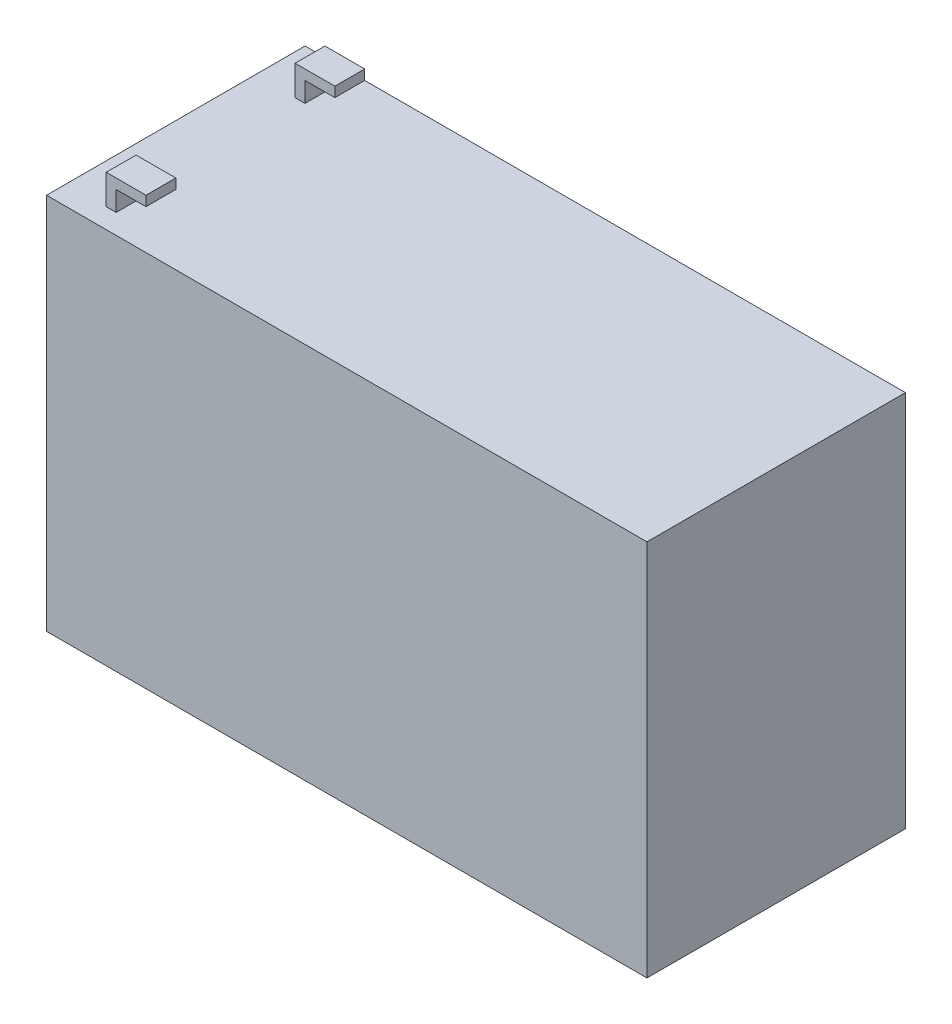
ISO-10303-21;
HEADER;
FILE_DESCRIPTION(('STEP AP214'),'2;1');
FILE_NAME('part.step','',(''),(''),'','','');
FILE_SCHEMA(('AUTOMOTIVE_DESIGN { 1 0 10303 214 1 1 1 1 }'));
ENDSEC;
DATA;
#1=APPLICATION_CONTEXT('core data for automotive mechanical design processes');
#2=APPLICATION_PROTOCOL_DEFINITION('international standard','automotive_design',2000,#1);
#3=PRODUCT_CONTEXT('',#1,'mechanical');
#4=PRODUCT('Part','Part','',(#3));
#5=PRODUCT_RELATED_PRODUCT_CATEGORY('part','',(#4));
#6=PRODUCT_DEFINITION_FORMATION('','',#4);
#7=PRODUCT_DEFINITION_CONTEXT('part definition',#1,'design');
#8=PRODUCT_DEFINITION('design','',#6,#7);
#9=PRODUCT_DEFINITION_SHAPE('','',#8);
#10=(LENGTH_UNIT() NAMED_UNIT(*) SI_UNIT(.MILLI.,.METRE.));
#11=(NAMED_UNIT(*) PLANE_ANGLE_UNIT() SI_UNIT($,.RADIAN.));
#12=(NAMED_UNIT(*) SI_UNIT($,.STERADIAN.) SOLID_ANGLE_UNIT());
#13=UNCERTAINTY_MEASURE_WITH_UNIT(LENGTH_MEASURE(1.E-05),#10,'distance_accuracy_value','');
#14=(GEOMETRIC_REPRESENTATION_CONTEXT(3) GLOBAL_UNCERTAINTY_ASSIGNED_CONTEXT((#13)) GLOBAL_UNIT_ASSIGNED_CONTEXT((#10,
#11,#12)) REPRESENTATION_CONTEXT('',''));
#15=CARTESIAN_POINT('',(0.,0.,0.));
#16=DIRECTION('',(0.,0.,1.));
#17=DIRECTION('',(1.,0.,0.));
#18=AXIS2_PLACEMENT_3D('',#15,#16,#17);
#19=CARTESIAN_POINT('',(-75.5,-47.5,-65.));
#20=DIRECTION('',(0.,-1.,0.));
#21=DIRECTION('',(0.,0.,-1.));
#22=AXIS2_PLACEMENT_3D('',#19,#20,#21);
#23=PLANE('',#22);
#24=DIRECTION('',(1.,0.,0.));
#25=VECTOR('',#24,1.);
#26=CARTESIAN_POINT('',(-75.5,-47.5,0.));
#27=LINE('',#26,#25);
#28=CARTESIAN_POINT('',(-75.5,-47.5,0.));
#29=VERTEX_POINT('',#28);
#30=CARTESIAN_POINT('',(75.5,-47.5,0.));
#31=VERTEX_POINT('',#30);
#32=EDGE_CURVE('E489',#29,#31,#27,.T.);
#33=ORIENTED_EDGE('',*,*,#32,.F.);
#34=DIRECTION('',(0.,0.,1.));
#35=VECTOR('',#34,1.);
#36=CARTESIAN_POINT('',(-75.5,-47.5,-65.));
#37=LINE('',#36,#35);
#38=CARTESIAN_POINT('',(-75.5,-47.5,-65.));
#39=VERTEX_POINT('',#38);
#40=EDGE_CURVE('E40',#39,#29,#37,.T.);
#41=ORIENTED_EDGE('',*,*,#40,.F.);
#42=DIRECTION('',(1.,0.,0.));
#43=VECTOR('',#42,1.);
#44=CARTESIAN_POINT('',(-75.5,-47.5,-65.));
#45=LINE('',#44,#43);
#46=CARTESIAN_POINT('',(75.5,-47.5,-65.));
#47=VERTEX_POINT('',#46);
#48=EDGE_CURVE('E477',#39,#47,#45,.T.);
#49=ORIENTED_EDGE('',*,*,#48,.T.);
#50=DIRECTION('',(0.,0.,1.));
#51=VECTOR('',#50,1.);
#52=CARTESIAN_POINT('',(75.5,-47.5,-65.));
#53=LINE('',#52,#51);
#54=EDGE_CURVE('E496',#47,#31,#53,.T.);
#55=ORIENTED_EDGE('',*,*,#54,.T.);
#56=EDGE_LOOP('',(#33,#41,#49,#55));
#57=FACE_BOUND('',#56,.T.);
#58=DIRECTION('',(0.,0.,1.));
#59=VECTOR('',#58,1.);
#60=CARTESIAN_POINT('',(-74.5,-47.5,-65.));
#61=LINE('',#60,#59);
#62=CARTESIAN_POINT('',(-74.5,-47.5,-64.));
#63=VERTEX_POINT('',#62);
#64=CARTESIAN_POINT('',(-74.5,-47.5,-1.));
#65=VERTEX_POINT('',#64);
#66=EDGE_CURVE('E335',#63,#65,#61,.T.);
#67=ORIENTED_EDGE('',*,*,#66,.T.);
#68=DIRECTION('',(1.,0.,0.));
#69=VECTOR('',#68,1.);
#70=CARTESIAN_POINT('',(0.,-47.5,-1.));
#71=LINE('',#70,#69);
#72=CARTESIAN_POINT('',(74.5,-47.5,-1.));
#73=VERTEX_POINT('',#72);
#74=EDGE_CURVE('E351',#65,#73,#71,.T.);
#75=ORIENTED_EDGE('',*,*,#74,.T.);
#76=DIRECTION('',(0.,0.,1.));
#77=VECTOR('',#76,1.);
#78=CARTESIAN_POINT('',(74.5,-47.5,-65.));
#79=LINE('',#78,#77);
#80=CARTESIAN_POINT('',(74.5,-47.5,-64.));
#81=VERTEX_POINT('',#80);
#82=EDGE_CURVE('E347',#81,#73,#79,.T.);
#83=ORIENTED_EDGE('',*,*,#82,.F.);
#84=DIRECTION('',(1.,0.,0.));
#85=VECTOR('',#84,1.);
#86=CARTESIAN_POINT('',(0.,-47.5,-64.));
#87=LINE('',#86,#85);
#88=EDGE_CURVE('E53',#63,#81,#87,.T.);
#89=ORIENTED_EDGE('',*,*,#88,.F.);
#90=EDGE_LOOP('',(#67,#75,#83,#89));
#91=FACE_BOUND('',#90,.T.);
#92=ADVANCED_FACE('F36',(#57,#91),#23,.T.);
#93=CARTESIAN_POINT('',(-65.5,47.5,-65.));
#94=DIRECTION('',(-1.,0.,0.));
#95=DIRECTION('',(0.,0.,1.));
#96=AXIS2_PLACEMENT_3D('',#93,#94,#95);
#97=PLANE('',#96);
#98=DIRECTION('',(0.,1.,0.));
#99=VECTOR('',#98,1.);
#100=CARTESIAN_POINT('',(-65.5,47.5,-60.));
#101=LINE('',#100,#99);
#102=CARTESIAN_POINT('',(-65.5,47.5,-60.));
#103=VERTEX_POINT('',#102);
#104=CARTESIAN_POINT('',(-65.5,55.,-60.));
#105=VERTEX_POINT('',#104);
#106=EDGE_CURVE('E399',#103,#105,#101,.T.);
#107=ORIENTED_EDGE('',*,*,#106,.F.);
#108=DIRECTION('',(0.,0.,1.));
#109=VECTOR('',#108,1.);
#110=CARTESIAN_POINT('',(-65.5,47.5,-65.));
#111=LINE('',#110,#109);
#112=CARTESIAN_POINT('',(-65.5,47.5,-52.5));
#113=VERTEX_POINT('',#112);
#114=EDGE_CURVE('E455',#103,#113,#111,.T.);
#115=ORIENTED_EDGE('',*,*,#114,.T.);
#116=DIRECTION('',(0.,-1.,0.));
#117=VECTOR('',#116,1.);
#118=CARTESIAN_POINT('',(-65.5,55.,-52.5));
#119=LINE('',#118,#117);
#120=CARTESIAN_POINT('',(-65.5,55.,-52.5));
#121=VERTEX_POINT('',#120);
#122=EDGE_CURVE('E420',#121,#113,#119,.T.);
#123=ORIENTED_EDGE('',*,*,#122,.F.);
#124=DIRECTION('',(0.,0.,1.));
#125=VECTOR('',#124,1.);
#126=CARTESIAN_POINT('',(-65.5,55.,-65.));
#127=LINE('',#126,#125);
#128=EDGE_CURVE('E456',#105,#121,#127,.T.);
#129=ORIENTED_EDGE('',*,*,#128,.F.);
#130=EDGE_LOOP('',(#107,#115,#123,#129));
#131=FACE_BOUND('',#130,.T.);
#132=ADVANCED_FACE('F527',(#131),#97,.T.);
#133=CARTESIAN_POINT('',(-65.5,55.,-65.));
#134=DIRECTION('',(0.,1.,0.));
#135=DIRECTION('',(0.,0.,1.));
#136=AXIS2_PLACEMENT_3D('',#133,#134,#135);
#137=PLANE('',#136);
#138=DIRECTION('',(-1.,0.,0.));
#139=VECTOR('',#138,1.);
#140=CARTESIAN_POINT('',(75.501,55.,-60.));
#141=LINE('',#140,#139);
#142=CARTESIAN_POINT('',(-55.5,55.,-60.));
#143=VERTEX_POINT('',#142);
#144=EDGE_CURVE('E401',#143,#105,#141,.T.);
#145=ORIENTED_EDGE('',*,*,#144,.T.);
#146=ORIENTED_EDGE('',*,*,#128,.T.);
#147=DIRECTION('',(-1.,0.,0.));
#148=VECTOR('',#147,1.);
#149=CARTESIAN_POINT('',(75.501,55.,-52.5));
#150=LINE('',#149,#148);
#151=CARTESIAN_POINT('',(-55.5,55.,-52.5));
#152=VERTEX_POINT('',#151);
#153=EDGE_CURVE('E426',#152,#121,#150,.T.);
#154=ORIENTED_EDGE('',*,*,#153,.F.);
#155=DIRECTION('',(0.,0.,1.));
#156=VECTOR('',#155,1.);
#157=CARTESIAN_POINT('',(-55.5,55.,-65.));
#158=LINE('',#157,#156);
#159=EDGE_CURVE('E460',#143,#152,#158,.T.);
#160=ORIENTED_EDGE('',*,*,#159,.F.);
#161=EDGE_LOOP('',(#145,#146,#154,#160));
#162=FACE_BOUND('',#161,.T.);
#163=ADVANCED_FACE('F531',(#162),#137,.T.);
#164=CARTESIAN_POINT('',(-55.5,55.,-65.));
#165=DIRECTION('',(1.,0.,0.));
#166=DIRECTION('',(0.,0.,-1.));
#167=AXIS2_PLACEMENT_3D('',#164,#165,#166);
#168=PLANE('',#167);
#169=DIRECTION('',(0.,1.,0.));
#170=VECTOR('',#169,1.);
#171=CARTESIAN_POINT('',(-55.5,47.5,-60.));
#172=LINE('',#171,#170);
#173=CARTESIAN_POINT('',(-55.5,52.5,-60.));
#174=VERTEX_POINT('',#173);
#175=EDGE_CURVE('E389',#174,#143,#172,.T.);
#176=ORIENTED_EDGE('',*,*,#175,.T.);
#177=ORIENTED_EDGE('',*,*,#159,.T.);
#178=DIRECTION('',(0.,-1.,0.));
#179=VECTOR('',#178,1.);
#180=CARTESIAN_POINT('',(-55.5,55.,-52.5));
#181=LINE('',#180,#179);
#182=CARTESIAN_POINT('',(-55.5,52.5,-52.5));
#183=VERTEX_POINT('',#182);
#184=EDGE_CURVE('E417',#152,#183,#181,.T.);
#185=ORIENTED_EDGE('',*,*,#184,.T.);
#186=DIRECTION('',(0.,0.,1.));
#187=VECTOR('',#186,1.);
#188=CARTESIAN_POINT('',(-55.5,52.5,-65.));
#189=LINE('',#188,#187);
#190=EDGE_CURVE('E464',#174,#183,#189,.T.);
#191=ORIENTED_EDGE('',*,*,#190,.F.);
#192=EDGE_LOOP('',(#176,#177,#185,#191));
#193=FACE_BOUND('',#192,.T.);
#194=ADVANCED_FACE('F538',(#193),#168,.T.);
#195=CARTESIAN_POINT('',(-55.5,52.5,-65.));
#196=DIRECTION('',(0.,-1.,0.));
#197=DIRECTION('',(0.,0.,-1.));
#198=AXIS2_PLACEMENT_3D('',#195,#196,#197);
#199=PLANE('',#198);
#200=DIRECTION('',(1.,0.,0.));
#201=VECTOR('',#200,1.);
#202=CARTESIAN_POINT('',(75.501,52.5,-60.));
#203=LINE('',#202,#201);
#204=CARTESIAN_POINT('',(-63.,52.5,-60.));
#205=VERTEX_POINT('',#204);
#206=EDGE_CURVE('E396',#205,#174,#203,.T.);
#207=ORIENTED_EDGE('',*,*,#206,.T.);
#208=ORIENTED_EDGE('',*,*,#190,.T.);
#209=DIRECTION('',(-1.,0.,0.));
#210=VECTOR('',#209,1.);
#211=CARTESIAN_POINT('',(75.501,52.5,-52.5));
#212=LINE('',#211,#210);
#213=CARTESIAN_POINT('',(-63.,52.5,-52.5));
#214=VERTEX_POINT('',#213);
#215=EDGE_CURVE('E414',#183,#214,#212,.T.);
#216=ORIENTED_EDGE('',*,*,#215,.T.);
#217=DIRECTION('',(0.,0.,1.));
#218=VECTOR('',#217,1.);
#219=CARTESIAN_POINT('',(-63.,52.5,-65.));
#220=LINE('',#219,#218);
#221=EDGE_CURVE('E468',#205,#214,#220,.T.);
#222=ORIENTED_EDGE('',*,*,#221,.F.);
#223=EDGE_LOOP('',(#207,#208,#216,#222));
#224=FACE_BOUND('',#223,.T.);
#225=ADVANCED_FACE('F579',(#224),#199,.T.);
#226=CARTESIAN_POINT('',(-63.,52.5,-65.));
#227=DIRECTION('',(1.,0.,0.));
#228=DIRECTION('',(0.,0.,-1.));
#229=AXIS2_PLACEMENT_3D('',#226,#227,#228);
#230=PLANE('',#229);
#231=DIRECTION('',(0.,1.,0.));
#232=VECTOR('',#231,1.);
#233=CARTESIAN_POINT('',(-63.,47.5,-60.));
#234=LINE('',#233,#232);
#235=CARTESIAN_POINT('',(-63.,47.5,-60.));
#236=VERTEX_POINT('',#235);
#237=EDGE_CURVE('E392',#236,#205,#234,.T.);
#238=ORIENTED_EDGE('',*,*,#237,.T.);
#239=ORIENTED_EDGE('',*,*,#221,.T.);
#240=DIRECTION('',(0.,-1.,0.));
#241=VECTOR('',#240,1.);
#242=CARTESIAN_POINT('',(-63.,55.,-52.5));
#243=LINE('',#242,#241);
#244=CARTESIAN_POINT('',(-63.,47.5,-52.5));
#245=VERTEX_POINT('',#244);
#246=EDGE_CURVE('E410',#214,#245,#243,.T.);
#247=ORIENTED_EDGE('',*,*,#246,.T.);
#248=DIRECTION('',(0.,0.,1.));
#249=VECTOR('',#248,1.);
#250=CARTESIAN_POINT('',(-63.,47.5,-65.));
#251=LINE('',#250,#249);
#252=EDGE_CURVE('E472',#236,#245,#251,.T.);
#253=ORIENTED_EDGE('',*,*,#252,.F.);
#254=EDGE_LOOP('',(#238,#239,#247,#253));
#255=FACE_BOUND('',#254,.T.);
#256=ADVANCED_FACE('F572',(#255),#230,.T.);
#257=CARTESIAN_POINT('',(-75.5,47.5,-65.));
#258=DIRECTION('',(-1.,0.,0.));
#259=DIRECTION('',(0.,0.,1.));
#260=AXIS2_PLACEMENT_3D('',#257,#258,#259);
#261=PLANE('',#260);
#262=DIRECTION('',(0.,-1.,0.));
#263=VECTOR('',#262,1.);
#264=CARTESIAN_POINT('',(-75.5,47.5,0.));
#265=LINE('',#264,#263);
#266=CARTESIAN_POINT('',(-75.5,47.5,0.));
#267=VERTEX_POINT('',#266);
#268=EDGE_CURVE('E486',#267,#29,#265,.T.);
#269=ORIENTED_EDGE('',*,*,#268,.F.);
#270=DIRECTION('',(0.,0.,1.));
#271=VECTOR('',#270,1.);
#272=CARTESIAN_POINT('',(-75.5,47.5,-65.));
#273=LINE('',#272,#271);
#274=CARTESIAN_POINT('',(-75.5,47.5,-65.));
#275=VERTEX_POINT('',#274);
#276=EDGE_CURVE('E11',#275,#267,#273,.T.);
#277=ORIENTED_EDGE('',*,*,#276,.F.);
#278=DIRECTION('',(0.,-1.,0.));
#279=VECTOR('',#278,1.);
#280=CARTESIAN_POINT('',(-75.5,47.5,-65.));
#281=LINE('',#280,#279);
#282=EDGE_CURVE('E474',#275,#39,#281,.T.);
#283=ORIENTED_EDGE('',*,*,#282,.T.);
#284=ORIENTED_EDGE('',*,*,#40,.T.);
#285=EDGE_LOOP('',(#269,#277,#283,#284));
#286=FACE_BOUND('',#285,.T.);
#287=ADVANCED_FACE('F38',(#286),#261,.T.);
#288=CARTESIAN_POINT('',(-75.5,47.5,-65.));
#289=DIRECTION('',(0.,1.,0.));
#290=DIRECTION('',(0.,0.,1.));
#291=AXIS2_PLACEMENT_3D('',#288,#289,#290);
#292=PLANE('',#291);
#293=ORIENTED_EDGE('',*,*,#114,.F.);
#294=DIRECTION('',(-1.,0.,0.));
#295=VECTOR('',#294,1.);
#296=CARTESIAN_POINT('',(75.501,47.5,-60.));
#297=LINE('',#296,#295);
#298=EDGE_CURVE('E402',#236,#103,#297,.T.);
#299=ORIENTED_EDGE('',*,*,#298,.F.);
#300=ORIENTED_EDGE('',*,*,#252,.T.);
#301=DIRECTION('',(-1.,0.,0.));
#302=VECTOR('',#301,1.);
#303=CARTESIAN_POINT('',(75.501,47.5,-52.5));
#304=LINE('',#303,#302);
#305=EDGE_CURVE('E425',#245,#113,#304,.T.);
#306=ORIENTED_EDGE('',*,*,#305,.T.);
#307=EDGE_LOOP('',(#293,#299,#300,#306));
#308=FACE_BOUND('',#307,.T.);
#309=CARTESIAN_POINT('',(-65.5,47.5,-12.5));
#310=VERTEX_POINT('',#309);
#311=CARTESIAN_POINT('',(-65.5,47.5,-5.));
#312=VERTEX_POINT('',#311);
#313=EDGE_CURVE('E452',#310,#312,#111,.T.);
#314=ORIENTED_EDGE('',*,*,#313,.F.);
#315=DIRECTION('',(-1.,0.,0.));
#316=VECTOR('',#315,1.);
#317=CARTESIAN_POINT('',(75.501,47.5,-12.5));
#318=LINE('',#317,#316);
#319=CARTESIAN_POINT('',(-63.,47.5,-12.5));
#320=VERTEX_POINT('',#319);
#321=EDGE_CURVE('E61',#320,#310,#318,.T.);
#322=ORIENTED_EDGE('',*,*,#321,.F.);
#323=CARTESIAN_POINT('',(-63.,47.5,-5.));
#324=VERTEX_POINT('',#323);
#325=EDGE_CURVE('E404',#320,#324,#251,.T.);
#326=ORIENTED_EDGE('',*,*,#325,.T.);
#327=DIRECTION('',(-1.,0.,0.));
#328=VECTOR('',#327,1.);
#329=CARTESIAN_POINT('',(75.501,47.5,-5.));
#330=LINE('',#329,#328);
#331=EDGE_CURVE('E449',#324,#312,#330,.T.);
#332=ORIENTED_EDGE('',*,*,#331,.T.);
#333=EDGE_LOOP('',(#314,#322,#326,#332));
#334=FACE_BOUND('',#333,.T.);
#335=DIRECTION('',(-1.,0.,0.));
#336=VECTOR('',#335,1.);
#337=CARTESIAN_POINT('',(-75.5,47.5,-65.));
#338=LINE('',#337,#336);
#339=CARTESIAN_POINT('',(75.5,47.5,-65.));
#340=VERTEX_POINT('',#339);
#341=EDGE_CURVE('E484',#340,#275,#338,.T.);
#342=ORIENTED_EDGE('',*,*,#341,.T.);
#343=ORIENTED_EDGE('',*,*,#276,.T.);
#344=DIRECTION('',(-1.,0.,0.));
#345=VECTOR('',#344,1.);
#346=CARTESIAN_POINT('',(-75.5,47.5,0.));
#347=LINE('',#346,#345);
#348=CARTESIAN_POINT('',(75.5,47.5,0.));
#349=VERTEX_POINT('',#348);
#350=EDGE_CURVE('E478',#349,#267,#347,.T.);
#351=ORIENTED_EDGE('',*,*,#350,.F.);
#352=DIRECTION('',(0.,0.,1.));
#353=VECTOR('',#352,1.);
#354=CARTESIAN_POINT('',(75.5,47.5,-65.));
#355=LINE('',#354,#353);
#356=EDGE_CURVE('E45',#340,#349,#355,.T.);
#357=ORIENTED_EDGE('',*,*,#356,.F.);
#358=EDGE_LOOP('',(#342,#343,#351,#357));
#359=FACE_BOUND('',#358,.T.);
#360=ADVANCED_FACE('F510',(#308,#334,#359),#292,.T.);
#361=CARTESIAN_POINT('',(75.5,47.5,-65.));
#362=DIRECTION('',(1.,0.,0.));
#363=DIRECTION('',(0.,0.,-1.));
#364=AXIS2_PLACEMENT_3D('',#361,#362,#363);
#365=PLANE('',#364);
#366=DIRECTION('',(0.,1.,0.));
#367=VECTOR('',#366,1.);
#368=CARTESIAN_POINT('',(75.5,47.5,0.));
#369=LINE('',#368,#367);
#370=EDGE_CURVE('E492',#31,#349,#369,.T.);
#371=ORIENTED_EDGE('',*,*,#370,.F.);
#372=ORIENTED_EDGE('',*,*,#54,.F.);
#373=DIRECTION('',(0.,1.,0.));
#374=VECTOR('',#373,1.);
#375=CARTESIAN_POINT('',(75.5,47.5,-65.));
#376=LINE('',#375,#374);
#377=EDGE_CURVE('E481',#47,#340,#376,.T.);
#378=ORIENTED_EDGE('',*,*,#377,.T.);
#379=ORIENTED_EDGE('',*,*,#356,.T.);
#380=EDGE_LOOP('',(#371,#372,#378,#379));
#381=FACE_BOUND('',#380,.T.);
#382=ADVANCED_FACE('F516',(#381),#365,.T.);
#383=CARTESIAN_POINT('',(0.,0.,-65.));
#384=DIRECTION('',(0.,0.,1.));
#385=DIRECTION('',(1.,0.,0.));
#386=AXIS2_PLACEMENT_3D('',#383,#384,#385);
#387=PLANE('',#386);
#388=ORIENTED_EDGE('',*,*,#282,.F.);
#389=ORIENTED_EDGE('',*,*,#341,.F.);
#390=ORIENTED_EDGE('',*,*,#377,.F.);
#391=ORIENTED_EDGE('',*,*,#48,.F.);
#392=EDGE_LOOP('',(#388,#389,#390,#391));
#393=FACE_BOUND('',#392,.T.);
#394=ADVANCED_FACE('F513',(#393),#387,.F.);
#395=CARTESIAN_POINT('',(0.,0.,0.));
#396=DIRECTION('',(0.,0.,1.));
#397=DIRECTION('',(1.,0.,0.));
#398=AXIS2_PLACEMENT_3D('',#395,#396,#397);
#399=PLANE('',#398);
#400=ORIENTED_EDGE('',*,*,#350,.T.);
#401=ORIENTED_EDGE('',*,*,#268,.T.);
#402=ORIENTED_EDGE('',*,*,#32,.T.);
#403=ORIENTED_EDGE('',*,*,#370,.T.);
#404=EDGE_LOOP('',(#400,#401,#402,#403));
#405=FACE_BOUND('',#404,.T.);
#406=ADVANCED_FACE('F507',(#405),#399,.T.);
#407=DIRECTION('',(0.,1.,0.));
#408=VECTOR('',#407,1.);
#409=CARTESIAN_POINT('',(-65.5,55.,-12.5));
#410=LINE('',#409,#408);
#411=CARTESIAN_POINT('',(-65.5,55.,-12.5));
#412=VERTEX_POINT('',#411);
#413=EDGE_CURVE('E423',#310,#412,#410,.T.);
#414=ORIENTED_EDGE('',*,*,#413,.F.);
#415=ORIENTED_EDGE('',*,*,#313,.T.);
#416=DIRECTION('',(0.,-1.,0.));
#417=VECTOR('',#416,1.);
#418=CARTESIAN_POINT('',(-65.5,55.,-5.));
#419=LINE('',#418,#417);
#420=CARTESIAN_POINT('',(-65.5,55.,-5.));
#421=VERTEX_POINT('',#420);
#422=EDGE_CURVE('E446',#421,#312,#419,.T.);
#423=ORIENTED_EDGE('',*,*,#422,.F.);
#424=EDGE_CURVE('E457',#412,#421,#127,.T.);
#425=ORIENTED_EDGE('',*,*,#424,.F.);
#426=EDGE_LOOP('',(#414,#415,#423,#425));
#427=FACE_BOUND('',#426,.T.);
#428=ADVANCED_FACE('F534',(#427),#97,.T.);
#429=DIRECTION('',(-1.,0.,0.));
#430=VECTOR('',#429,1.);
#431=CARTESIAN_POINT('',(75.501,55.,-12.5));
#432=LINE('',#431,#430);
#433=CARTESIAN_POINT('',(-55.5,55.,-12.5));
#434=VERTEX_POINT('',#433);
#435=EDGE_CURVE('E429',#434,#412,#432,.T.);
#436=ORIENTED_EDGE('',*,*,#435,.T.);
#437=ORIENTED_EDGE('',*,*,#424,.T.);
#438=DIRECTION('',(-1.,0.,0.));
#439=VECTOR('',#438,1.);
#440=CARTESIAN_POINT('',(75.501,55.,-5.));
#441=LINE('',#440,#439);
#442=CARTESIAN_POINT('',(-55.5,55.,-5.));
#443=VERTEX_POINT('',#442);
#444=EDGE_CURVE('E411',#443,#421,#441,.T.);
#445=ORIENTED_EDGE('',*,*,#444,.F.);
#446=EDGE_CURVE('E461',#434,#443,#158,.T.);
#447=ORIENTED_EDGE('',*,*,#446,.F.);
#448=EDGE_LOOP('',(#436,#437,#445,#447));
#449=FACE_BOUND('',#448,.T.);
#450=ADVANCED_FACE('F541',(#449),#137,.T.);
#451=DIRECTION('',(0.,1.,0.));
#452=VECTOR('',#451,1.);
#453=CARTESIAN_POINT('',(-55.5,55.,-12.5));
#454=LINE('',#453,#452);
#455=CARTESIAN_POINT('',(-55.5,52.5,-12.5));
#456=VERTEX_POINT('',#455);
#457=EDGE_CURVE('E393',#456,#434,#454,.T.);
#458=ORIENTED_EDGE('',*,*,#457,.T.);
#459=ORIENTED_EDGE('',*,*,#446,.T.);
#460=DIRECTION('',(0.,-1.,0.));
#461=VECTOR('',#460,1.);
#462=CARTESIAN_POINT('',(-55.5,55.,-5.));
#463=LINE('',#462,#461);
#464=CARTESIAN_POINT('',(-55.5,52.5,-5.));
#465=VERTEX_POINT('',#464);
#466=EDGE_CURVE('E443',#443,#465,#463,.T.);
#467=ORIENTED_EDGE('',*,*,#466,.T.);
#468=EDGE_CURVE('E465',#456,#465,#189,.T.);
#469=ORIENTED_EDGE('',*,*,#468,.F.);
#470=EDGE_LOOP('',(#458,#459,#467,#469));
#471=FACE_BOUND('',#470,.T.);
#472=ADVANCED_FACE('F550',(#471),#168,.T.);
#473=DIRECTION('',(1.,0.,0.));
#474=VECTOR('',#473,1.);
#475=CARTESIAN_POINT('',(75.501,52.5,-12.5));
#476=LINE('',#475,#474);
#477=CARTESIAN_POINT('',(-63.,52.5,-12.5));
#478=VERTEX_POINT('',#477);
#479=EDGE_CURVE('E428',#478,#456,#476,.T.);
#480=ORIENTED_EDGE('',*,*,#479,.T.);
#481=ORIENTED_EDGE('',*,*,#468,.T.);
#482=DIRECTION('',(-1.,0.,0.));
#483=VECTOR('',#482,1.);
#484=CARTESIAN_POINT('',(75.501,52.5,-5.));
#485=LINE('',#484,#483);
#486=CARTESIAN_POINT('',(-63.,52.5,-5.));
#487=VERTEX_POINT('',#486);
#488=EDGE_CURVE('E440',#465,#487,#485,.T.);
#489=ORIENTED_EDGE('',*,*,#488,.T.);
#490=EDGE_CURVE('E469',#478,#487,#220,.T.);
#491=ORIENTED_EDGE('',*,*,#490,.F.);
#492=EDGE_LOOP('',(#480,#481,#489,#491));
#493=FACE_BOUND('',#492,.T.);
#494=ADVANCED_FACE('F566',(#493),#199,.T.);
#495=DIRECTION('',(0.,1.,0.));
#496=VECTOR('',#495,1.);
#497=CARTESIAN_POINT('',(-63.,55.,-12.5));
#498=LINE('',#497,#496);
#499=EDGE_CURVE('E407',#320,#478,#498,.T.);
#500=ORIENTED_EDGE('',*,*,#499,.T.);
#501=ORIENTED_EDGE('',*,*,#490,.T.);
#502=DIRECTION('',(0.,-1.,0.));
#503=VECTOR('',#502,1.);
#504=CARTESIAN_POINT('',(-63.,55.,-5.));
#505=LINE('',#504,#503);
#506=EDGE_CURVE('E340',#487,#324,#505,.T.);
#507=ORIENTED_EDGE('',*,*,#506,.T.);
#508=ORIENTED_EDGE('',*,*,#325,.F.);
#509=EDGE_LOOP('',(#500,#501,#507,#508));
#510=FACE_BOUND('',#509,.T.);
#511=ADVANCED_FACE('F569',(#510),#230,.T.);
#512=CARTESIAN_POINT('',(75.501,55.,-5.));
#513=DIRECTION('',(0.,0.,-1.));
#514=DIRECTION('',(0.,1.,0.));
#515=AXIS2_PLACEMENT_3D('',#512,#513,#514);
#516=PLANE('',#515);
#517=ORIENTED_EDGE('',*,*,#444,.T.);
#518=ORIENTED_EDGE('',*,*,#422,.T.);
#519=ORIENTED_EDGE('',*,*,#331,.F.);
#520=ORIENTED_EDGE('',*,*,#506,.F.);
#521=ORIENTED_EDGE('',*,*,#488,.F.);
#522=ORIENTED_EDGE('',*,*,#466,.F.);
#523=EDGE_LOOP('',(#517,#518,#519,#520,#521,#522));
#524=FACE_BOUND('',#523,.T.);
#525=ADVANCED_FACE('F559',(#524),#516,.F.);
#526=CARTESIAN_POINT('',(75.501,55.,-52.5));
#527=DIRECTION('',(0.,0.,-1.));
#528=DIRECTION('',(-1.,0.,0.));
#529=AXIS2_PLACEMENT_3D('',#526,#527,#528);
#530=PLANE('',#529);
#531=ORIENTED_EDGE('',*,*,#153,.T.);
#532=ORIENTED_EDGE('',*,*,#122,.T.);
#533=ORIENTED_EDGE('',*,*,#305,.F.);
#534=ORIENTED_EDGE('',*,*,#246,.F.);
#535=ORIENTED_EDGE('',*,*,#215,.F.);
#536=ORIENTED_EDGE('',*,*,#184,.F.);
#537=EDGE_LOOP('',(#531,#532,#533,#534,#535,#536));
#538=FACE_BOUND('',#537,.T.);
#539=ADVANCED_FACE('F577',(#538),#530,.F.);
#540=CARTESIAN_POINT('',(75.501,55.,-12.5));
#541=DIRECTION('',(0.,0.,1.));
#542=DIRECTION('',(1.,0.,0.));
#543=AXIS2_PLACEMENT_3D('',#540,#541,#542);
#544=PLANE('',#543);
#545=ORIENTED_EDGE('',*,*,#479,.F.);
#546=ORIENTED_EDGE('',*,*,#499,.F.);
#547=ORIENTED_EDGE('',*,*,#321,.T.);
#548=ORIENTED_EDGE('',*,*,#413,.T.);
#549=ORIENTED_EDGE('',*,*,#435,.F.);
#550=ORIENTED_EDGE('',*,*,#457,.F.);
#551=EDGE_LOOP('',(#545,#546,#547,#548,#549,#550));
#552=FACE_BOUND('',#551,.T.);
#553=ADVANCED_FACE('F562',(#552),#544,.F.);
#554=CARTESIAN_POINT('',(75.501,47.5,-60.));
#555=DIRECTION('',(0.,0.,1.));
#556=DIRECTION('',(1.,0.,0.));
#557=AXIS2_PLACEMENT_3D('',#554,#555,#556);
#558=PLANE('',#557);
#559=ORIENTED_EDGE('',*,*,#206,.F.);
#560=ORIENTED_EDGE('',*,*,#237,.F.);
#561=ORIENTED_EDGE('',*,*,#298,.T.);
#562=ORIENTED_EDGE('',*,*,#106,.T.);
#563=ORIENTED_EDGE('',*,*,#144,.F.);
#564=ORIENTED_EDGE('',*,*,#175,.F.);
#565=EDGE_LOOP('',(#559,#560,#561,#562,#563,#564));
#566=FACE_BOUND('',#565,.T.);
#567=ADVANCED_FACE('F605',(#566),#558,.F.);
#568=CARTESIAN_POINT('',(-64.5,47.5,-65.));
#569=DIRECTION('',(-1.,0.,0.));
#570=DIRECTION('',(0.,0.,1.));
#571=AXIS2_PLACEMENT_3D('',#568,#569,#570);
#572=PLANE('',#571);
#573=DIRECTION('',(0.,1.,0.));
#574=VECTOR('',#573,1.);
#575=CARTESIAN_POINT('',(-64.5,47.5,-59.));
#576=LINE('',#575,#574);
#577=CARTESIAN_POINT('',(-64.5,46.5,-59.));
#578=VERTEX_POINT('',#577);
#579=CARTESIAN_POINT('',(-64.5,54.,-59.));
#580=VERTEX_POINT('',#579);
#581=EDGE_CURVE('E251',#578,#580,#576,.T.);
#582=ORIENTED_EDGE('',*,*,#581,.T.);
#583=DIRECTION('',(0.,0.,1.));
#584=VECTOR('',#583,1.);
#585=CARTESIAN_POINT('',(-64.5,54.,-65.));
#586=LINE('',#585,#584);
#587=CARTESIAN_POINT('',(-64.5,54.,-53.5));
#588=VERTEX_POINT('',#587);
#589=EDGE_CURVE('E256',#580,#588,#586,.T.);
#590=ORIENTED_EDGE('',*,*,#589,.T.);
#591=DIRECTION('',(0.,-1.,0.));
#592=VECTOR('',#591,1.);
#593=CARTESIAN_POINT('',(-64.5,47.5,-53.5));
#594=LINE('',#593,#592);
#595=CARTESIAN_POINT('',(-64.5,46.5,-53.5));
#596=VERTEX_POINT('',#595);
#597=EDGE_CURVE('E285',#588,#596,#594,.T.);
#598=ORIENTED_EDGE('',*,*,#597,.T.);
#599=DIRECTION('',(0.,0.,1.));
#600=VECTOR('',#599,1.);
#601=CARTESIAN_POINT('',(-64.5,46.5,-65.));
#602=LINE('',#601,#600);
#603=EDGE_CURVE('E258',#578,#596,#602,.T.);
#604=ORIENTED_EDGE('',*,*,#603,.F.);
#605=EDGE_LOOP('',(#582,#590,#598,#604));
#606=FACE_BOUND('',#605,.T.);
#607=ADVANCED_FACE('F253',(#606),#572,.F.);
#608=CARTESIAN_POINT('',(-65.5,54.,-65.));
#609=DIRECTION('',(0.,1.,0.));
#610=DIRECTION('',(0.,0.,1.));
#611=AXIS2_PLACEMENT_3D('',#608,#609,#610);
#612=PLANE('',#611);
#613=DIRECTION('',(-1.,0.,0.));
#614=VECTOR('',#613,1.);
#615=CARTESIAN_POINT('',(75.501,54.,-59.));
#616=LINE('',#615,#614);
#617=CARTESIAN_POINT('',(-56.5,54.,-59.));
#618=VERTEX_POINT('',#617);
#619=EDGE_CURVE('E260',#618,#580,#616,.T.);
#620=ORIENTED_EDGE('',*,*,#619,.F.);
#621=DIRECTION('',(0.,0.,1.));
#622=VECTOR('',#621,1.);
#623=CARTESIAN_POINT('',(-56.5,54.,-65.));
#624=LINE('',#623,#622);
#625=CARTESIAN_POINT('',(-56.5,54.,-53.5));
#626=VERTEX_POINT('',#625);
#627=EDGE_CURVE('E282',#618,#626,#624,.T.);
#628=ORIENTED_EDGE('',*,*,#627,.T.);
#629=DIRECTION('',(-1.,0.,0.));
#630=VECTOR('',#629,1.);
#631=CARTESIAN_POINT('',(-65.5,54.,-53.5));
#632=LINE('',#631,#630);
#633=EDGE_CURVE('E274',#626,#588,#632,.T.);
#634=ORIENTED_EDGE('',*,*,#633,.T.);
#635=ORIENTED_EDGE('',*,*,#589,.F.);
#636=EDGE_LOOP('',(#620,#628,#634,#635));
#637=FACE_BOUND('',#636,.T.);
#638=ADVANCED_FACE('F272',(#637),#612,.F.);
#639=CARTESIAN_POINT('',(-56.5,55.,-65.));
#640=DIRECTION('',(1.,0.,0.));
#641=DIRECTION('',(0.,0.,-1.));
#642=AXIS2_PLACEMENT_3D('',#639,#640,#641);
#643=PLANE('',#642);
#644=DIRECTION('',(0.,1.,0.));
#645=VECTOR('',#644,1.);
#646=CARTESIAN_POINT('',(-56.5,47.5,-59.));
#647=LINE('',#646,#645);
#648=CARTESIAN_POINT('',(-56.5,53.5,-59.));
#649=VERTEX_POINT('',#648);
#650=EDGE_CURVE('E266',#649,#618,#647,.T.);
#651=ORIENTED_EDGE('',*,*,#650,.F.);
#652=DIRECTION('',(0.,0.,1.));
#653=VECTOR('',#652,1.);
#654=CARTESIAN_POINT('',(-56.5,53.5,-65.));
#655=LINE('',#654,#653);
#656=CARTESIAN_POINT('',(-56.5,53.5,-53.5));
#657=VERTEX_POINT('',#656);
#658=EDGE_CURVE('E300',#649,#657,#655,.T.);
#659=ORIENTED_EDGE('',*,*,#658,.T.);
#660=DIRECTION('',(0.,-1.,0.));
#661=VECTOR('',#660,1.);
#662=CARTESIAN_POINT('',(-56.5,55.,-53.5));
#663=LINE('',#662,#661);
#664=EDGE_CURVE('E296',#626,#657,#663,.T.);
#665=ORIENTED_EDGE('',*,*,#664,.F.);
#666=ORIENTED_EDGE('',*,*,#627,.F.);
#667=EDGE_LOOP('',(#651,#659,#665,#666));
#668=FACE_BOUND('',#667,.T.);
#669=ADVANCED_FACE('F650',(#668),#643,.F.);
#670=CARTESIAN_POINT('',(-55.5,53.5,-65.));
#671=DIRECTION('',(0.,-1.,0.));
#672=DIRECTION('',(0.,0.,-1.));
#673=AXIS2_PLACEMENT_3D('',#670,#671,#672);
#674=PLANE('',#673);
#675=DIRECTION('',(1.,0.,0.));
#676=VECTOR('',#675,1.);
#677=CARTESIAN_POINT('',(75.501,53.5,-59.));
#678=LINE('',#677,#676);
#679=CARTESIAN_POINT('',(-64.,53.5,-59.));
#680=VERTEX_POINT('',#679);
#681=EDGE_CURVE('E261',#680,#649,#678,.T.);
#682=ORIENTED_EDGE('',*,*,#681,.F.);
#683=DIRECTION('',(0.,0.,1.));
#684=VECTOR('',#683,1.);
#685=CARTESIAN_POINT('',(-64.,53.5,-65.));
#686=LINE('',#685,#684);
#687=CARTESIAN_POINT('',(-64.,53.5,-53.5));
#688=VERTEX_POINT('',#687);
#689=EDGE_CURVE('E308',#680,#688,#686,.T.);
#690=ORIENTED_EDGE('',*,*,#689,.T.);
#691=DIRECTION('',(-1.,0.,0.));
#692=VECTOR('',#691,1.);
#693=CARTESIAN_POINT('',(75.501,53.5,-53.5));
#694=LINE('',#693,#692);
#695=EDGE_CURVE('E299',#657,#688,#694,.T.);
#696=ORIENTED_EDGE('',*,*,#695,.F.);
#697=ORIENTED_EDGE('',*,*,#658,.F.);
#698=EDGE_LOOP('',(#682,#690,#696,#697));
#699=FACE_BOUND('',#698,.T.);
#700=ADVANCED_FACE('F660',(#699),#674,.F.);
#701=CARTESIAN_POINT('',(-64.,52.5,-65.));
#702=DIRECTION('',(1.,0.,0.));
#703=DIRECTION('',(0.,0.,-1.));
#704=AXIS2_PLACEMENT_3D('',#701,#702,#703);
#705=PLANE('',#704);
#706=DIRECTION('',(0.,1.,0.));
#707=VECTOR('',#706,1.);
#708=CARTESIAN_POINT('',(-64.,47.5,-59.));
#709=LINE('',#708,#707);
#710=CARTESIAN_POINT('',(-64.,46.5,-59.));
#711=VERTEX_POINT('',#710);
#712=EDGE_CURVE('E294',#711,#680,#709,.T.);
#713=ORIENTED_EDGE('',*,*,#712,.F.);
#714=DIRECTION('',(0.,0.,1.));
#715=VECTOR('',#714,1.);
#716=CARTESIAN_POINT('',(-64.,46.5,-65.));
#717=LINE('',#716,#715);
#718=CARTESIAN_POINT('',(-64.,46.5,-53.5));
#719=VERTEX_POINT('',#718);
#720=EDGE_CURVE('E317',#711,#719,#717,.T.);
#721=ORIENTED_EDGE('',*,*,#720,.T.);
#722=DIRECTION('',(0.,-1.,0.));
#723=VECTOR('',#722,1.);
#724=CARTESIAN_POINT('',(-64.,55.,-53.5));
#725=LINE('',#724,#723);
#726=EDGE_CURVE('E307',#688,#719,#725,.T.);
#727=ORIENTED_EDGE('',*,*,#726,.F.);
#728=ORIENTED_EDGE('',*,*,#689,.F.);
#729=EDGE_LOOP('',(#713,#721,#727,#728));
#730=FACE_BOUND('',#729,.T.);
#731=ADVANCED_FACE('F671',(#730),#705,.F.);
#732=CARTESIAN_POINT('',(-74.5,47.5,-65.));
#733=DIRECTION('',(-1.,0.,0.));
#734=DIRECTION('',(0.,0.,1.));
#735=AXIS2_PLACEMENT_3D('',#732,#733,#734);
#736=PLANE('',#735);
#737=DIRECTION('',(0.,-1.,0.));
#738=VECTOR('',#737,1.);
#739=CARTESIAN_POINT('',(-74.5,0.,-1.));
#740=LINE('',#739,#738);
#741=CARTESIAN_POINT('',(-74.5,46.5,-1.));
#742=VERTEX_POINT('',#741);
#743=EDGE_CURVE('E348',#742,#65,#740,.T.);
#744=ORIENTED_EDGE('',*,*,#743,.T.);
#745=ORIENTED_EDGE('',*,*,#66,.F.);
#746=DIRECTION('',(0.,-1.,0.));
#747=VECTOR('',#746,1.);
#748=CARTESIAN_POINT('',(-74.5,0.,-64.));
#749=LINE('',#748,#747);
#750=CARTESIAN_POINT('',(-74.5,46.5,-64.));
#751=VERTEX_POINT('',#750);
#752=EDGE_CURVE('E344',#751,#63,#749,.T.);
#753=ORIENTED_EDGE('',*,*,#752,.F.);
#754=DIRECTION('',(0.,0.,1.));
#755=VECTOR('',#754,1.);
#756=CARTESIAN_POINT('',(-74.5,46.5,-65.));
#757=LINE('',#756,#755);
#758=EDGE_CURVE('E337',#751,#742,#757,.T.);
#759=ORIENTED_EDGE('',*,*,#758,.T.);
#760=EDGE_LOOP('',(#744,#745,#753,#759));
#761=FACE_BOUND('',#760,.T.);
#762=ADVANCED_FACE('F682',(#761),#736,.F.);
#763=CARTESIAN_POINT('',(-75.5,46.5,-65.));
#764=DIRECTION('',(0.,1.,0.));
#765=DIRECTION('',(0.,0.,1.));
#766=AXIS2_PLACEMENT_3D('',#763,#764,#765);
#767=PLANE('',#766);
#768=ORIENTED_EDGE('',*,*,#603,.T.);
#769=DIRECTION('',(-1.,0.,0.));
#770=VECTOR('',#769,1.);
#771=CARTESIAN_POINT('',(-75.5,46.5,-53.5));
#772=LINE('',#771,#770);
#773=EDGE_CURVE('E322',#719,#596,#772,.T.);
#774=ORIENTED_EDGE('',*,*,#773,.F.);
#775=ORIENTED_EDGE('',*,*,#720,.F.);
#776=DIRECTION('',(-1.,0.,0.));
#777=VECTOR('',#776,1.);
#778=CARTESIAN_POINT('',(75.501,46.5,-59.));
#779=LINE('',#778,#777);
#780=EDGE_CURVE('E270',#711,#578,#779,.T.);
#781=ORIENTED_EDGE('',*,*,#780,.T.);
#782=EDGE_LOOP('',(#768,#774,#775,#781));
#783=FACE_BOUND('',#782,.T.);
#784=DIRECTION('',(0.,0.,1.));
#785=VECTOR('',#784,1.);
#786=CARTESIAN_POINT('',(-64.5,46.5,-65.));
#787=LINE('',#786,#785);
#788=CARTESIAN_POINT('',(-64.5,46.5,-11.5));
#789=VERTEX_POINT('',#788);
#790=CARTESIAN_POINT('',(-64.5,46.5,-6.));
#791=VERTEX_POINT('',#790);
#792=EDGE_CURVE('E276',#789,#791,#787,.T.);
#793=ORIENTED_EDGE('',*,*,#792,.T.);
#794=DIRECTION('',(-1.,0.,0.));
#795=VECTOR('',#794,1.);
#796=CARTESIAN_POINT('',(-75.5,46.5,-6.));
#797=LINE('',#796,#795);
#798=CARTESIAN_POINT('',(-64.,46.5,-6.));
#799=VERTEX_POINT('',#798);
#800=EDGE_CURVE('E329',#799,#791,#797,.T.);
#801=ORIENTED_EDGE('',*,*,#800,.F.);
#802=DIRECTION('',(0.,0.,1.));
#803=VECTOR('',#802,1.);
#804=CARTESIAN_POINT('',(-64.,46.5,-65.));
#805=LINE('',#804,#803);
#806=CARTESIAN_POINT('',(-64.,46.5,-11.5));
#807=VERTEX_POINT('',#806);
#808=EDGE_CURVE('E320',#807,#799,#805,.T.);
#809=ORIENTED_EDGE('',*,*,#808,.F.);
#810=DIRECTION('',(-1.,0.,0.));
#811=VECTOR('',#810,1.);
#812=CARTESIAN_POINT('',(75.501,46.5,-11.5));
#813=LINE('',#812,#811);
#814=EDGE_CURVE('E323',#807,#789,#813,.T.);
#815=ORIENTED_EDGE('',*,*,#814,.T.);
#816=EDGE_LOOP('',(#793,#801,#809,#815));
#817=FACE_BOUND('',#816,.T.);
#818=DIRECTION('',(-1.,0.,0.));
#819=VECTOR('',#818,1.);
#820=CARTESIAN_POINT('',(0.,46.5,-64.));
#821=LINE('',#820,#819);
#822=CARTESIAN_POINT('',(74.5,46.5,-64.));
#823=VERTEX_POINT('',#822);
#824=EDGE_CURVE('E333',#823,#751,#821,.T.);
#825=ORIENTED_EDGE('',*,*,#824,.F.);
#826=DIRECTION('',(0.,0.,1.));
#827=VECTOR('',#826,1.);
#828=CARTESIAN_POINT('',(74.5,46.5,-65.));
#829=LINE('',#828,#827);
#830=CARTESIAN_POINT('',(74.5,46.5,-1.));
#831=VERTEX_POINT('',#830);
#832=EDGE_CURVE('E341',#823,#831,#829,.T.);
#833=ORIENTED_EDGE('',*,*,#832,.T.);
#834=DIRECTION('',(-1.,0.,0.));
#835=VECTOR('',#834,1.);
#836=CARTESIAN_POINT('',(0.,46.5,-1.));
#837=LINE('',#836,#835);
#838=EDGE_CURVE('E342',#831,#742,#837,.T.);
#839=ORIENTED_EDGE('',*,*,#838,.T.);
#840=ORIENTED_EDGE('',*,*,#758,.F.);
#841=EDGE_LOOP('',(#825,#833,#839,#840));
#842=FACE_BOUND('',#841,.T.);
#843=ADVANCED_FACE('F693',(#783,#817,#842),#767,.F.);
#844=CARTESIAN_POINT('',(74.5,47.5,-65.));
#845=DIRECTION('',(1.,0.,0.));
#846=DIRECTION('',(0.,0.,-1.));
#847=AXIS2_PLACEMENT_3D('',#844,#845,#846);
#848=PLANE('',#847);
#849=DIRECTION('',(0.,1.,0.));
#850=VECTOR('',#849,1.);
#851=CARTESIAN_POINT('',(74.5,0.,-1.));
#852=LINE('',#851,#850);
#853=EDGE_CURVE('E345',#73,#831,#852,.T.);
#854=ORIENTED_EDGE('',*,*,#853,.T.);
#855=ORIENTED_EDGE('',*,*,#832,.F.);
#856=DIRECTION('',(0.,1.,0.));
#857=VECTOR('',#856,1.);
#858=CARTESIAN_POINT('',(74.5,0.,-64.));
#859=LINE('',#858,#857);
#860=EDGE_CURVE('E336',#81,#823,#859,.T.);
#861=ORIENTED_EDGE('',*,*,#860,.F.);
#862=ORIENTED_EDGE('',*,*,#82,.T.);
#863=EDGE_LOOP('',(#854,#855,#861,#862));
#864=FACE_BOUND('',#863,.T.);
#865=ADVANCED_FACE('F704',(#864),#848,.F.);
#866=CARTESIAN_POINT('',(0.,0.,-64.));
#867=DIRECTION('',(0.,0.,1.));
#868=DIRECTION('',(1.,0.,0.));
#869=AXIS2_PLACEMENT_3D('',#866,#867,#868);
#870=PLANE('',#869);
#871=ORIENTED_EDGE('',*,*,#752,.T.);
#872=ORIENTED_EDGE('',*,*,#88,.T.);
#873=ORIENTED_EDGE('',*,*,#860,.T.);
#874=ORIENTED_EDGE('',*,*,#824,.T.);
#875=EDGE_LOOP('',(#871,#872,#873,#874));
#876=FACE_BOUND('',#875,.T.);
#877=ADVANCED_FACE('F715',(#876),#870,.T.);
#878=CARTESIAN_POINT('',(0.,0.,-1.));
#879=DIRECTION('',(0.,0.,1.));
#880=DIRECTION('',(1.,0.,0.));
#881=AXIS2_PLACEMENT_3D('',#878,#879,#880);
#882=PLANE('',#881);
#883=ORIENTED_EDGE('',*,*,#838,.F.);
#884=ORIENTED_EDGE('',*,*,#853,.F.);
#885=ORIENTED_EDGE('',*,*,#74,.F.);
#886=ORIENTED_EDGE('',*,*,#743,.F.);
#887=EDGE_LOOP('',(#883,#884,#885,#886));
#888=FACE_BOUND('',#887,.T.);
#889=ADVANCED_FACE('F726',(#888),#882,.F.);
#890=DIRECTION('',(0.,1.,0.));
#891=VECTOR('',#890,1.);
#892=CARTESIAN_POINT('',(-64.5,47.5,-11.5));
#893=LINE('',#892,#891);
#894=CARTESIAN_POINT('',(-64.5,54.,-11.5));
#895=VERTEX_POINT('',#894);
#896=EDGE_CURVE('E324',#789,#895,#893,.T.);
#897=ORIENTED_EDGE('',*,*,#896,.T.);
#898=DIRECTION('',(0.,0.,1.));
#899=VECTOR('',#898,1.);
#900=CARTESIAN_POINT('',(-64.5,54.,-65.));
#901=LINE('',#900,#899);
#902=CARTESIAN_POINT('',(-64.5,54.,-6.));
#903=VERTEX_POINT('',#902);
#904=EDGE_CURVE('E277',#895,#903,#901,.T.);
#905=ORIENTED_EDGE('',*,*,#904,.T.);
#906=DIRECTION('',(0.,-1.,0.));
#907=VECTOR('',#906,1.);
#908=CARTESIAN_POINT('',(-64.5,47.5,-6.));
#909=LINE('',#908,#907);
#910=EDGE_CURVE('E332',#903,#791,#909,.T.);
#911=ORIENTED_EDGE('',*,*,#910,.T.);
#912=ORIENTED_EDGE('',*,*,#792,.F.);
#913=EDGE_LOOP('',(#897,#905,#911,#912));
#914=FACE_BOUND('',#913,.T.);
#915=ADVANCED_FACE('F613',(#914),#572,.F.);
#916=DIRECTION('',(-1.,0.,0.));
#917=VECTOR('',#916,1.);
#918=CARTESIAN_POINT('',(75.501,54.,-11.5));
#919=LINE('',#918,#917);
#920=CARTESIAN_POINT('',(-56.5,54.,-11.5));
#921=VERTEX_POINT('',#920);
#922=EDGE_CURVE('E290',#921,#895,#919,.T.);
#923=ORIENTED_EDGE('',*,*,#922,.F.);
#924=DIRECTION('',(0.,0.,1.));
#925=VECTOR('',#924,1.);
#926=CARTESIAN_POINT('',(-56.5,54.,-65.));
#927=LINE('',#926,#925);
#928=CARTESIAN_POINT('',(-56.5,54.,-6.));
#929=VERTEX_POINT('',#928);
#930=EDGE_CURVE('E292',#921,#929,#927,.T.);
#931=ORIENTED_EDGE('',*,*,#930,.T.);
#932=DIRECTION('',(-1.,0.,0.));
#933=VECTOR('',#932,1.);
#934=CARTESIAN_POINT('',(-65.5,54.,-6.));
#935=LINE('',#934,#933);
#936=EDGE_CURVE('E331',#929,#903,#935,.T.);
#937=ORIENTED_EDGE('',*,*,#936,.T.);
#938=ORIENTED_EDGE('',*,*,#904,.F.);
#939=EDGE_LOOP('',(#923,#931,#937,#938));
#940=FACE_BOUND('',#939,.T.);
#941=ADVANCED_FACE('F652',(#940),#612,.F.);
#942=DIRECTION('',(0.,1.,0.));
#943=VECTOR('',#942,1.);
#944=CARTESIAN_POINT('',(-56.5,55.,-11.5));
#945=LINE('',#944,#943);
#946=CARTESIAN_POINT('',(-56.5,53.5,-11.5));
#947=VERTEX_POINT('',#946);
#948=EDGE_CURVE('E295',#947,#921,#945,.T.);
#949=ORIENTED_EDGE('',*,*,#948,.F.);
#950=DIRECTION('',(0.,0.,1.));
#951=VECTOR('',#950,1.);
#952=CARTESIAN_POINT('',(-56.5,53.5,-65.));
#953=LINE('',#952,#951);
#954=CARTESIAN_POINT('',(-56.5,53.5,-6.));
#955=VERTEX_POINT('',#954);
#956=EDGE_CURVE('E303',#947,#955,#953,.T.);
#957=ORIENTED_EDGE('',*,*,#956,.T.);
#958=DIRECTION('',(0.,-1.,0.));
#959=VECTOR('',#958,1.);
#960=CARTESIAN_POINT('',(-56.5,55.,-6.));
#961=LINE('',#960,#959);
#962=EDGE_CURVE('E358',#929,#955,#961,.T.);
#963=ORIENTED_EDGE('',*,*,#962,.F.);
#964=ORIENTED_EDGE('',*,*,#930,.F.);
#965=EDGE_LOOP('',(#949,#957,#963,#964));
#966=FACE_BOUND('',#965,.T.);
#967=ADVANCED_FACE('F663',(#966),#643,.F.);
#968=DIRECTION('',(1.,0.,0.));
#969=VECTOR('',#968,1.);
#970=CARTESIAN_POINT('',(75.501,53.5,-11.5));
#971=LINE('',#970,#969);
#972=CARTESIAN_POINT('',(-64.,53.5,-11.5));
#973=VERTEX_POINT('',#972);
#974=EDGE_CURVE('E289',#973,#947,#971,.T.);
#975=ORIENTED_EDGE('',*,*,#974,.F.);
#976=DIRECTION('',(0.,0.,1.));
#977=VECTOR('',#976,1.);
#978=CARTESIAN_POINT('',(-64.,53.5,-65.));
#979=LINE('',#978,#977);
#980=CARTESIAN_POINT('',(-64.,53.5,-6.));
#981=VERTEX_POINT('',#980);
#982=EDGE_CURVE('E311',#973,#981,#979,.T.);
#983=ORIENTED_EDGE('',*,*,#982,.T.);
#984=DIRECTION('',(-1.,0.,0.));
#985=VECTOR('',#984,1.);
#986=CARTESIAN_POINT('',(75.501,53.5,-6.));
#987=LINE('',#986,#985);
#988=EDGE_CURVE('E369',#955,#981,#987,.T.);
#989=ORIENTED_EDGE('',*,*,#988,.F.);
#990=ORIENTED_EDGE('',*,*,#956,.F.);
#991=EDGE_LOOP('',(#975,#983,#989,#990));
#992=FACE_BOUND('',#991,.T.);
#993=ADVANCED_FACE('F674',(#992),#674,.F.);
#994=DIRECTION('',(0.,1.,0.));
#995=VECTOR('',#994,1.);
#996=CARTESIAN_POINT('',(-64.,55.,-11.5));
#997=LINE('',#996,#995);
#998=EDGE_CURVE('E316',#807,#973,#997,.T.);
#999=ORIENTED_EDGE('',*,*,#998,.F.);
#1000=ORIENTED_EDGE('',*,*,#808,.T.);
#1001=DIRECTION('',(0.,-1.,0.));
#1002=VECTOR('',#1001,1.);
#1003=CARTESIAN_POINT('',(-64.,55.,-6.));
#1004=LINE('',#1003,#1002);
#1005=EDGE_CURVE('E376',#981,#799,#1004,.T.);
#1006=ORIENTED_EDGE('',*,*,#1005,.F.);
#1007=ORIENTED_EDGE('',*,*,#982,.F.);
#1008=EDGE_LOOP('',(#999,#1000,#1006,#1007));
#1009=FACE_BOUND('',#1008,.T.);
#1010=ADVANCED_FACE('F685',(#1009),#705,.F.);
#1011=CARTESIAN_POINT('',(75.501,55.,-6.));
#1012=DIRECTION('',(0.,0.,-1.));
#1013=DIRECTION('',(0.,1.,0.));
#1014=AXIS2_PLACEMENT_3D('',#1011,#1012,#1013);
#1015=PLANE('',#1014);
#1016=ORIENTED_EDGE('',*,*,#936,.F.);
#1017=ORIENTED_EDGE('',*,*,#962,.T.);
#1018=ORIENTED_EDGE('',*,*,#988,.T.);
#1019=ORIENTED_EDGE('',*,*,#1005,.T.);
#1020=ORIENTED_EDGE('',*,*,#800,.T.);
#1021=ORIENTED_EDGE('',*,*,#910,.F.);
#1022=EDGE_LOOP('',(#1016,#1017,#1018,#1019,#1020,#1021));
#1023=FACE_BOUND('',#1022,.T.);
#1024=ADVANCED_FACE('F777',(#1023),#1015,.T.);
#1025=CARTESIAN_POINT('',(75.501,55.,-53.5));
#1026=DIRECTION('',(0.,0.,-1.));
#1027=DIRECTION('',(-1.,0.,0.));
#1028=AXIS2_PLACEMENT_3D('',#1025,#1026,#1027);
#1029=PLANE('',#1028);
#1030=ORIENTED_EDGE('',*,*,#633,.F.);
#1031=ORIENTED_EDGE('',*,*,#664,.T.);
#1032=ORIENTED_EDGE('',*,*,#695,.T.);
#1033=ORIENTED_EDGE('',*,*,#726,.T.);
#1034=ORIENTED_EDGE('',*,*,#773,.T.);
#1035=ORIENTED_EDGE('',*,*,#597,.F.);
#1036=EDGE_LOOP('',(#1030,#1031,#1032,#1033,#1034,#1035));
#1037=FACE_BOUND('',#1036,.T.);
#1038=ADVANCED_FACE('F786',(#1037),#1029,.T.);
#1039=CARTESIAN_POINT('',(75.501,55.,-11.5));
#1040=DIRECTION('',(0.,0.,1.));
#1041=DIRECTION('',(1.,0.,0.));
#1042=AXIS2_PLACEMENT_3D('',#1039,#1040,#1041);
#1043=PLANE('',#1042);
#1044=ORIENTED_EDGE('',*,*,#974,.T.);
#1045=ORIENTED_EDGE('',*,*,#948,.T.);
#1046=ORIENTED_EDGE('',*,*,#922,.T.);
#1047=ORIENTED_EDGE('',*,*,#896,.F.);
#1048=ORIENTED_EDGE('',*,*,#814,.F.);
#1049=ORIENTED_EDGE('',*,*,#998,.T.);
#1050=EDGE_LOOP('',(#1044,#1045,#1046,#1047,#1048,#1049));
#1051=FACE_BOUND('',#1050,.T.);
#1052=ADVANCED_FACE('F796',(#1051),#1043,.T.);
#1053=CARTESIAN_POINT('',(75.501,47.5,-59.));
#1054=DIRECTION('',(0.,0.,1.));
#1055=DIRECTION('',(1.,0.,0.));
#1056=AXIS2_PLACEMENT_3D('',#1053,#1054,#1055);
#1057=PLANE('',#1056);
#1058=ORIENTED_EDGE('',*,*,#681,.T.);
#1059=ORIENTED_EDGE('',*,*,#650,.T.);
#1060=ORIENTED_EDGE('',*,*,#619,.T.);
#1061=ORIENTED_EDGE('',*,*,#581,.F.);
#1062=ORIENTED_EDGE('',*,*,#780,.F.);
#1063=ORIENTED_EDGE('',*,*,#712,.T.);
#1064=EDGE_LOOP('',(#1058,#1059,#1060,#1061,#1062,#1063));
#1065=FACE_BOUND('',#1064,.T.);
#1066=ADVANCED_FACE('F265',(#1065),#1057,.T.);
#1067=CLOSED_SHELL('',(#92,#132,#163,#194,#225,#256,#287,#360,#382,#394,#406,#428,#450,#472,
#494,#511,#525,#539,#553,#567,#607,#638,#669,#700,#731,#762,#843,#865,#877,#889,#915,#941,#967,
#993,#1010,#1024,#1038,#1052,#1066));
#1068=MANIFOLD_SOLID_BREP('B2',#1067);
#1069=ADVANCED_BREP_SHAPE_REPRESENTATION('',(#18,#1068),#14);
#1070=SHAPE_DEFINITION_REPRESENTATION(#9,#1069);
ENDSEC;
END-ISO-10303-21;
